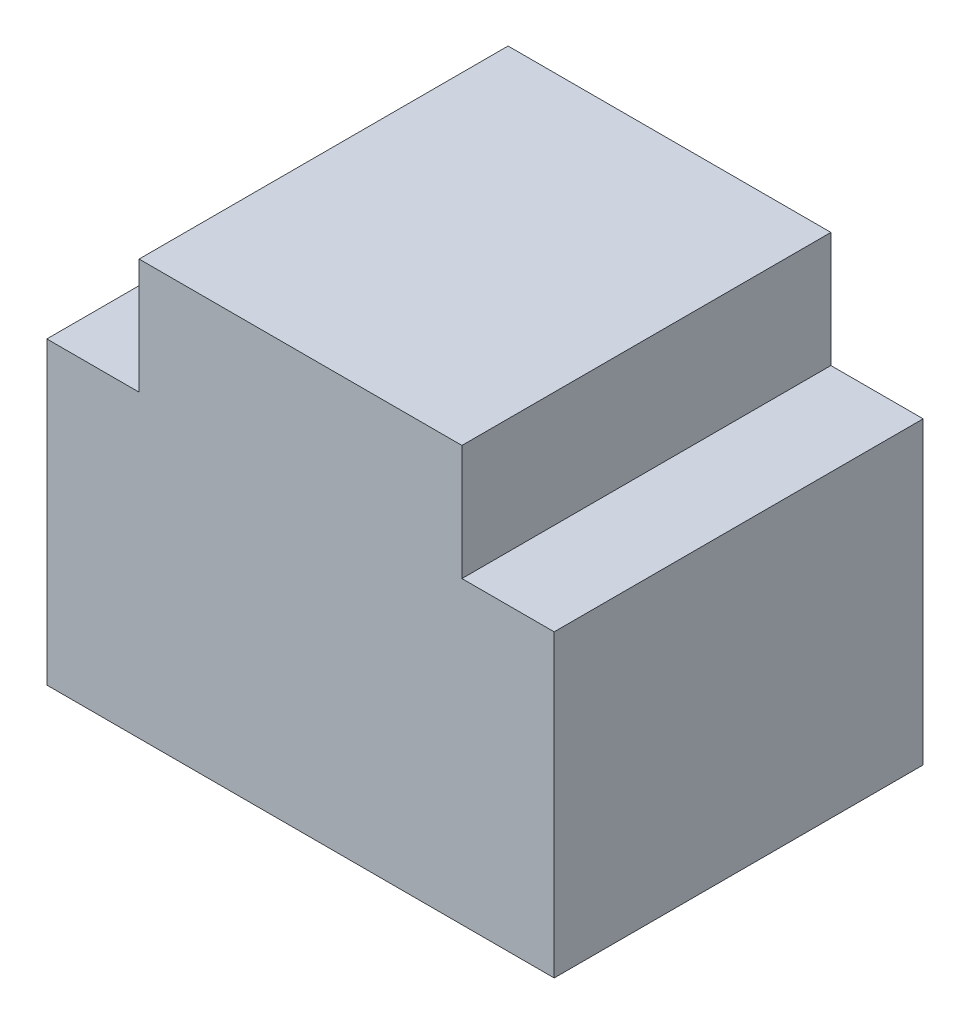
ISO-10303-21;
HEADER;
FILE_DESCRIPTION(('STEP AP214'),'2;1');
FILE_NAME('part.step','',(''),(''),'','','');
FILE_SCHEMA(('AUTOMOTIVE_DESIGN { 1 0 10303 214 1 1 1 1 }'));
ENDSEC;
DATA;
#1=APPLICATION_CONTEXT('core data for automotive mechanical design processes');
#2=APPLICATION_PROTOCOL_DEFINITION('international standard','automotive_design',2000,#1);
#3=PRODUCT_CONTEXT('',#1,'mechanical');
#4=PRODUCT('Part','Part','',(#3));
#5=PRODUCT_RELATED_PRODUCT_CATEGORY('part','',(#4));
#6=PRODUCT_DEFINITION_FORMATION('','',#4);
#7=PRODUCT_DEFINITION_CONTEXT('part definition',#1,'design');
#8=PRODUCT_DEFINITION('design','',#6,#7);
#9=PRODUCT_DEFINITION_SHAPE('','',#8);
#10=(LENGTH_UNIT() NAMED_UNIT(*) SI_UNIT(.MILLI.,.METRE.));
#11=(NAMED_UNIT(*) PLANE_ANGLE_UNIT() SI_UNIT($,.RADIAN.));
#12=(NAMED_UNIT(*) SI_UNIT($,.STERADIAN.) SOLID_ANGLE_UNIT());
#13=UNCERTAINTY_MEASURE_WITH_UNIT(LENGTH_MEASURE(1.E-05),#10,'distance_accuracy_value','');
#14=(GEOMETRIC_REPRESENTATION_CONTEXT(3) GLOBAL_UNCERTAINTY_ASSIGNED_CONTEXT((#13)) GLOBAL_UNIT_ASSIGNED_CONTEXT((#10,
#11,#12)) REPRESENTATION_CONTEXT('',''));
#15=CARTESIAN_POINT('',(0.,0.,0.));
#16=DIRECTION('',(0.,0.,1.));
#17=DIRECTION('',(1.,0.,0.));
#18=AXIS2_PLACEMENT_3D('',#15,#16,#17);
#19=CARTESIAN_POINT('',(0.,-2.5,8.));
#20=DIRECTION('',(1.,0.,0.));
#21=DIRECTION('',(0.,0.,-1.));
#22=AXIS2_PLACEMENT_3D('',#19,#20,#21);
#23=PLANE('',#22);
#24=DIRECTION('',(0.,-1.,0.));
#25=VECTOR('',#24,1.);
#26=CARTESIAN_POINT('',(0.,-2.5,0.));
#27=LINE('',#26,#25);
#28=CARTESIAN_POINT('',(0.,0.,0.));
#29=VERTEX_POINT('',#28);
#30=CARTESIAN_POINT('',(0.,-2.5,0.));
#31=VERTEX_POINT('',#30);
#32=EDGE_CURVE('E140',#29,#31,#27,.T.);
#33=ORIENTED_EDGE('',*,*,#32,.T.);
#34=DIRECTION('',(0.,0.,-1.));
#35=VECTOR('',#34,1.);
#36=CARTESIAN_POINT('',(0.,-2.5,8.));
#37=LINE('',#36,#35);
#38=CARTESIAN_POINT('',(0.,-2.5,8.));
#39=VERTEX_POINT('',#38);
#40=EDGE_CURVE('E11',#39,#31,#37,.T.);
#41=ORIENTED_EDGE('',*,*,#40,.F.);
#42=DIRECTION('',(0.,-1.,0.));
#43=VECTOR('',#42,1.);
#44=CARTESIAN_POINT('',(0.,-2.5,8.));
#45=LINE('',#44,#43);
#46=CARTESIAN_POINT('',(0.,0.,8.));
#47=VERTEX_POINT('',#46);
#48=EDGE_CURVE('E162',#47,#39,#45,.T.);
#49=ORIENTED_EDGE('',*,*,#48,.F.);
#50=DIRECTION('',(0.,0.,-1.));
#51=VECTOR('',#50,1.);
#52=CARTESIAN_POINT('',(0.,0.,8.));
#53=LINE('',#52,#51);
#54=EDGE_CURVE('E136',#47,#29,#53,.T.);
#55=ORIENTED_EDGE('',*,*,#54,.T.);
#56=EDGE_LOOP('',(#33,#41,#49,#55));
#57=FACE_BOUND('',#56,.T.);
#58=ADVANCED_FACE('F39',(#57),#23,.F.);
#59=CARTESIAN_POINT('',(-2.,-2.5,8.));
#60=DIRECTION('',(0.,-1.,0.));
#61=DIRECTION('',(0.,0.,-1.));
#62=AXIS2_PLACEMENT_3D('',#59,#60,#61);
#63=PLANE('',#62);
#64=DIRECTION('',(-1.,0.,0.));
#65=VECTOR('',#64,1.);
#66=CARTESIAN_POINT('',(-2.,-2.5,0.));
#67=LINE('',#66,#65);
#68=CARTESIAN_POINT('',(-2.,-2.5,0.));
#69=VERTEX_POINT('',#68);
#70=EDGE_CURVE('E144',#31,#69,#67,.T.);
#71=ORIENTED_EDGE('',*,*,#70,.T.);
#72=DIRECTION('',(0.,0.,-1.));
#73=VECTOR('',#72,1.);
#74=CARTESIAN_POINT('',(-2.,-2.5,8.));
#75=LINE('',#74,#73);
#76=CARTESIAN_POINT('',(-2.,-2.5,8.));
#77=VERTEX_POINT('',#76);
#78=EDGE_CURVE('E48',#77,#69,#75,.T.);
#79=ORIENTED_EDGE('',*,*,#78,.F.);
#80=DIRECTION('',(-1.,0.,0.));
#81=VECTOR('',#80,1.);
#82=CARTESIAN_POINT('',(-2.,-2.5,8.));
#83=LINE('',#82,#81);
#84=EDGE_CURVE('E99',#39,#77,#83,.T.);
#85=ORIENTED_EDGE('',*,*,#84,.F.);
#86=ORIENTED_EDGE('',*,*,#40,.T.);
#87=EDGE_LOOP('',(#71,#79,#85,#86));
#88=FACE_BOUND('',#87,.T.);
#89=ADVANCED_FACE('F208',(#88),#63,.F.);
#90=CARTESIAN_POINT('',(-2.,-9.,8.));
#91=DIRECTION('',(1.,0.,0.));
#92=DIRECTION('',(0.,0.,-1.));
#93=AXIS2_PLACEMENT_3D('',#90,#91,#92);
#94=PLANE('',#93);
#95=DIRECTION('',(0.,-1.,0.));
#96=VECTOR('',#95,1.);
#97=CARTESIAN_POINT('',(-2.,-9.,0.));
#98=LINE('',#97,#96);
#99=CARTESIAN_POINT('',(-2.,-9.,0.));
#100=VERTEX_POINT('',#99);
#101=EDGE_CURVE('E147',#69,#100,#98,.T.);
#102=ORIENTED_EDGE('',*,*,#101,.T.);
#103=DIRECTION('',(0.,0.,-1.));
#104=VECTOR('',#103,1.);
#105=CARTESIAN_POINT('',(-2.,-9.,8.));
#106=LINE('',#105,#104);
#107=CARTESIAN_POINT('',(-2.,-9.,8.));
#108=VERTEX_POINT('',#107);
#109=EDGE_CURVE('E173',#108,#100,#106,.T.);
#110=ORIENTED_EDGE('',*,*,#109,.F.);
#111=DIRECTION('',(0.,-1.,0.));
#112=VECTOR('',#111,1.);
#113=CARTESIAN_POINT('',(-2.,-9.,8.));
#114=LINE('',#113,#112);
#115=EDGE_CURVE('E183',#77,#108,#114,.T.);
#116=ORIENTED_EDGE('',*,*,#115,.F.);
#117=ORIENTED_EDGE('',*,*,#78,.T.);
#118=EDGE_LOOP('',(#102,#110,#116,#117));
#119=FACE_BOUND('',#118,.T.);
#120=ADVANCED_FACE('F181',(#119),#94,.F.);
#121=CARTESIAN_POINT('',(9.,-9.,8.));
#122=DIRECTION('',(0.,1.,0.));
#123=DIRECTION('',(0.,0.,1.));
#124=AXIS2_PLACEMENT_3D('',#121,#122,#123);
#125=PLANE('',#124);
#126=DIRECTION('',(1.,0.,0.));
#127=VECTOR('',#126,1.);
#128=CARTESIAN_POINT('',(9.,-9.,0.));
#129=LINE('',#128,#127);
#130=CARTESIAN_POINT('',(9.,-9.,0.));
#131=VERTEX_POINT('',#130);
#132=EDGE_CURVE('E150',#100,#131,#129,.T.);
#133=ORIENTED_EDGE('',*,*,#132,.T.);
#134=DIRECTION('',(0.,0.,-1.));
#135=VECTOR('',#134,1.);
#136=CARTESIAN_POINT('',(9.,-9.,8.));
#137=LINE('',#136,#135);
#138=CARTESIAN_POINT('',(9.,-9.,8.));
#139=VERTEX_POINT('',#138);
#140=EDGE_CURVE('E169',#139,#131,#137,.T.);
#141=ORIENTED_EDGE('',*,*,#140,.F.);
#142=DIRECTION('',(1.,0.,0.));
#143=VECTOR('',#142,1.);
#144=CARTESIAN_POINT('',(9.,-9.,8.));
#145=LINE('',#144,#143);
#146=EDGE_CURVE('E196',#108,#139,#145,.T.);
#147=ORIENTED_EDGE('',*,*,#146,.F.);
#148=ORIENTED_EDGE('',*,*,#109,.T.);
#149=EDGE_LOOP('',(#133,#141,#147,#148));
#150=FACE_BOUND('',#149,.T.);
#151=ADVANCED_FACE('F191',(#150),#125,.F.);
#152=CARTESIAN_POINT('',(9.,-2.5,8.));
#153=DIRECTION('',(-1.,0.,0.));
#154=DIRECTION('',(0.,0.,1.));
#155=AXIS2_PLACEMENT_3D('',#152,#153,#154);
#156=PLANE('',#155);
#157=DIRECTION('',(0.,1.,0.));
#158=VECTOR('',#157,1.);
#159=CARTESIAN_POINT('',(9.,-2.5,0.));
#160=LINE('',#159,#158);
#161=CARTESIAN_POINT('',(9.,-2.5,0.));
#162=VERTEX_POINT('',#161);
#163=EDGE_CURVE('E153',#131,#162,#160,.T.);
#164=ORIENTED_EDGE('',*,*,#163,.T.);
#165=DIRECTION('',(0.,0.,-1.));
#166=VECTOR('',#165,1.);
#167=CARTESIAN_POINT('',(9.,-2.5,8.));
#168=LINE('',#167,#166);
#169=CARTESIAN_POINT('',(9.,-2.5,8.));
#170=VERTEX_POINT('',#169);
#171=EDGE_CURVE('E129',#170,#162,#168,.T.);
#172=ORIENTED_EDGE('',*,*,#171,.F.);
#173=DIRECTION('',(0.,1.,0.));
#174=VECTOR('',#173,1.);
#175=CARTESIAN_POINT('',(9.,-2.5,8.));
#176=LINE('',#175,#174);
#177=EDGE_CURVE('E118',#139,#170,#176,.T.);
#178=ORIENTED_EDGE('',*,*,#177,.F.);
#179=ORIENTED_EDGE('',*,*,#140,.T.);
#180=EDGE_LOOP('',(#164,#172,#178,#179));
#181=FACE_BOUND('',#180,.T.);
#182=ADVANCED_FACE('F194',(#181),#156,.F.);
#183=CARTESIAN_POINT('',(7.,-2.5,8.));
#184=DIRECTION('',(0.,-1.,0.));
#185=DIRECTION('',(0.,0.,-1.));
#186=AXIS2_PLACEMENT_3D('',#183,#184,#185);
#187=PLANE('',#186);
#188=DIRECTION('',(-1.,0.,0.));
#189=VECTOR('',#188,1.);
#190=CARTESIAN_POINT('',(7.,-2.5,0.));
#191=LINE('',#190,#189);
#192=CARTESIAN_POINT('',(7.,-2.5,0.));
#193=VERTEX_POINT('',#192);
#194=EDGE_CURVE('E127',#162,#193,#191,.T.);
#195=ORIENTED_EDGE('',*,*,#194,.T.);
#196=DIRECTION('',(0.,0.,-1.));
#197=VECTOR('',#196,1.);
#198=CARTESIAN_POINT('',(7.,-2.5,8.));
#199=LINE('',#198,#197);
#200=CARTESIAN_POINT('',(7.,-2.5,8.));
#201=VERTEX_POINT('',#200);
#202=EDGE_CURVE('E124',#201,#193,#199,.T.);
#203=ORIENTED_EDGE('',*,*,#202,.F.);
#204=DIRECTION('',(-1.,0.,0.));
#205=VECTOR('',#204,1.);
#206=CARTESIAN_POINT('',(7.,-2.5,8.));
#207=LINE('',#206,#205);
#208=EDGE_CURVE('E112',#170,#201,#207,.T.);
#209=ORIENTED_EDGE('',*,*,#208,.F.);
#210=ORIENTED_EDGE('',*,*,#171,.T.);
#211=EDGE_LOOP('',(#195,#203,#209,#210));
#212=FACE_BOUND('',#211,.T.);
#213=ADVANCED_FACE('F125',(#212),#187,.F.);
#214=CARTESIAN_POINT('',(7.,0.,8.));
#215=DIRECTION('',(-1.,0.,0.));
#216=DIRECTION('',(0.,0.,1.));
#217=AXIS2_PLACEMENT_3D('',#214,#215,#216);
#218=PLANE('',#217);
#219=DIRECTION('',(0.,1.,0.));
#220=VECTOR('',#219,1.);
#221=CARTESIAN_POINT('',(7.,0.,0.));
#222=LINE('',#221,#220);
#223=CARTESIAN_POINT('',(7.,0.,0.));
#224=VERTEX_POINT('',#223);
#225=EDGE_CURVE('E85',#193,#224,#222,.T.);
#226=ORIENTED_EDGE('',*,*,#225,.T.);
#227=DIRECTION('',(0.,0.,-1.));
#228=VECTOR('',#227,1.);
#229=CARTESIAN_POINT('',(7.,0.,8.));
#230=LINE('',#229,#228);
#231=CARTESIAN_POINT('',(7.,0.,8.));
#232=VERTEX_POINT('',#231);
#233=EDGE_CURVE('E130',#232,#224,#230,.T.);
#234=ORIENTED_EDGE('',*,*,#233,.F.);
#235=DIRECTION('',(0.,1.,0.));
#236=VECTOR('',#235,1.);
#237=CARTESIAN_POINT('',(7.,0.,8.));
#238=LINE('',#237,#236);
#239=EDGE_CURVE('E116',#201,#232,#238,.T.);
#240=ORIENTED_EDGE('',*,*,#239,.F.);
#241=ORIENTED_EDGE('',*,*,#202,.T.);
#242=EDGE_LOOP('',(#226,#234,#240,#241));
#243=FACE_BOUND('',#242,.T.);
#244=ADVANCED_FACE('F132',(#243),#218,.F.);
#245=CARTESIAN_POINT('',(0.,0.,8.));
#246=DIRECTION('',(0.,-1.,0.));
#247=DIRECTION('',(0.,0.,-1.));
#248=AXIS2_PLACEMENT_3D('',#245,#246,#247);
#249=PLANE('',#248);
#250=DIRECTION('',(-1.,0.,0.));
#251=VECTOR('',#250,1.);
#252=CARTESIAN_POINT('',(0.,0.,0.));
#253=LINE('',#252,#251);
#254=EDGE_CURVE('E91',#224,#29,#253,.T.);
#255=ORIENTED_EDGE('',*,*,#254,.T.);
#256=ORIENTED_EDGE('',*,*,#54,.F.);
#257=DIRECTION('',(-1.,0.,0.));
#258=VECTOR('',#257,1.);
#259=CARTESIAN_POINT('',(0.,0.,8.));
#260=LINE('',#259,#258);
#261=EDGE_CURVE('E56',#232,#47,#260,.T.);
#262=ORIENTED_EDGE('',*,*,#261,.F.);
#263=ORIENTED_EDGE('',*,*,#233,.T.);
#264=EDGE_LOOP('',(#255,#256,#262,#263));
#265=FACE_BOUND('',#264,.T.);
#266=ADVANCED_FACE('F224',(#265),#249,.F.);
#267=CARTESIAN_POINT('',(0.,0.,8.));
#268=DIRECTION('',(0.,0.,-1.));
#269=DIRECTION('',(-1.,0.,0.));
#270=AXIS2_PLACEMENT_3D('',#267,#268,#269);
#271=PLANE('',#270);
#272=ORIENTED_EDGE('',*,*,#48,.T.);
#273=ORIENTED_EDGE('',*,*,#84,.T.);
#274=ORIENTED_EDGE('',*,*,#115,.T.);
#275=ORIENTED_EDGE('',*,*,#146,.T.);
#276=ORIENTED_EDGE('',*,*,#177,.T.);
#277=ORIENTED_EDGE('',*,*,#208,.T.);
#278=ORIENTED_EDGE('',*,*,#239,.T.);
#279=ORIENTED_EDGE('',*,*,#261,.T.);
#280=EDGE_LOOP('',(#272,#273,#274,#275,#276,#277,#278,#279));
#281=FACE_BOUND('',#280,.T.);
#282=ADVANCED_FACE('F114',(#281),#271,.F.);
#283=CARTESIAN_POINT('',(0.,0.,0.));
#284=DIRECTION('',(0.,0.,-1.));
#285=DIRECTION('',(-1.,0.,0.));
#286=AXIS2_PLACEMENT_3D('',#283,#284,#285);
#287=PLANE('',#286);
#288=ORIENTED_EDGE('',*,*,#32,.F.);
#289=ORIENTED_EDGE('',*,*,#254,.F.);
#290=ORIENTED_EDGE('',*,*,#225,.F.);
#291=ORIENTED_EDGE('',*,*,#194,.F.);
#292=ORIENTED_EDGE('',*,*,#163,.F.);
#293=ORIENTED_EDGE('',*,*,#132,.F.);
#294=ORIENTED_EDGE('',*,*,#101,.F.);
#295=ORIENTED_EDGE('',*,*,#70,.F.);
#296=EDGE_LOOP('',(#288,#289,#290,#291,#292,#293,#294,#295));
#297=FACE_BOUND('',#296,.T.);
#298=ADVANCED_FACE('F187',(#297),#287,.T.);
#299=CLOSED_SHELL('',(#58,#89,#120,#151,#182,#213,#244,#266,#282,#298));
#300=MANIFOLD_SOLID_BREP('B2',#299);
#301=ADVANCED_BREP_SHAPE_REPRESENTATION('',(#18,#300),#14);
#302=SHAPE_DEFINITION_REPRESENTATION(#9,#301);
ENDSEC;
END-ISO-10303-21;
